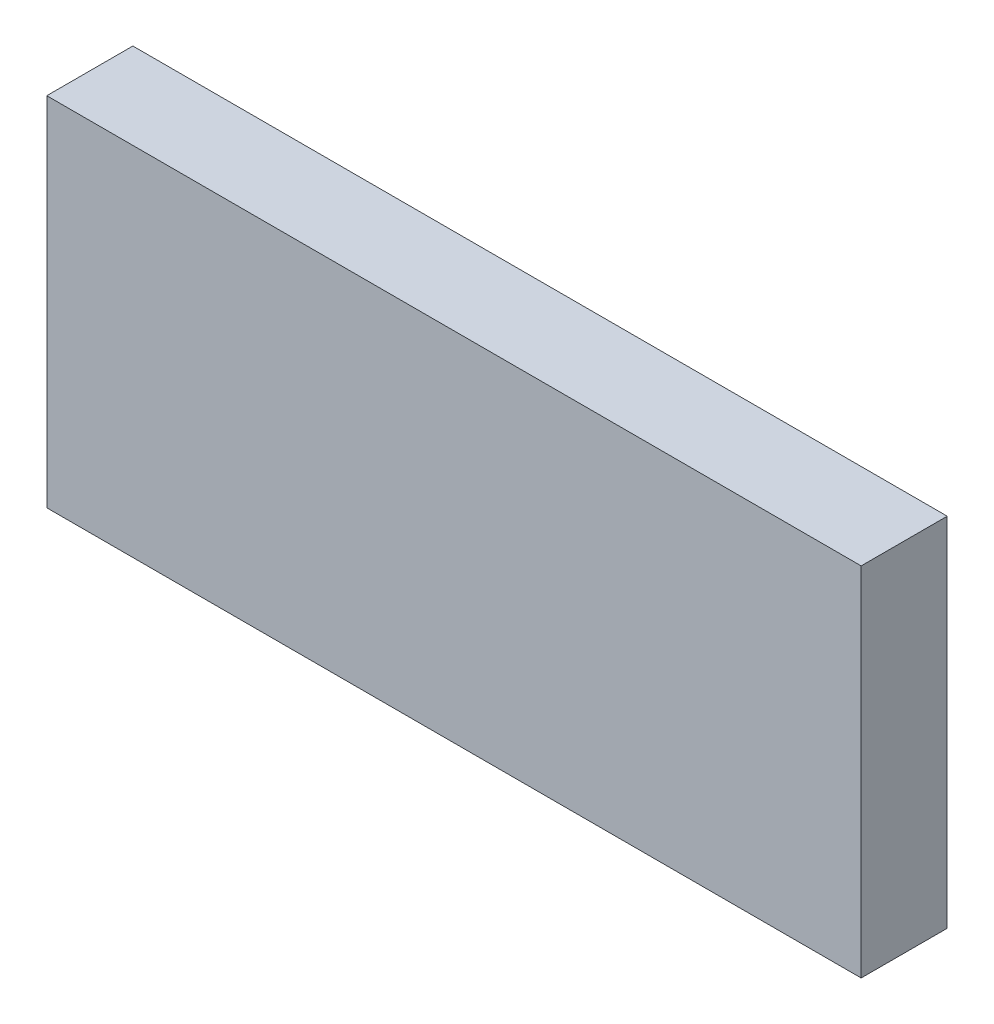
ISO-10303-21;
HEADER;
FILE_DESCRIPTION(('STEP AP214'),'2;1');
FILE_NAME('part.step','',(''),(''),'','','');
FILE_SCHEMA(('AUTOMOTIVE_DESIGN { 1 0 10303 214 1 1 1 1 }'));
ENDSEC;
DATA;
#1=APPLICATION_CONTEXT('core data for automotive mechanical design processes');
#2=APPLICATION_PROTOCOL_DEFINITION('international standard','automotive_design',2000,#1);
#3=PRODUCT_CONTEXT('',#1,'mechanical');
#4=PRODUCT('Part','Part','',(#3));
#5=PRODUCT_RELATED_PRODUCT_CATEGORY('part','',(#4));
#6=PRODUCT_DEFINITION_FORMATION('','',#4);
#7=PRODUCT_DEFINITION_CONTEXT('part definition',#1,'design');
#8=PRODUCT_DEFINITION('design','',#6,#7);
#9=PRODUCT_DEFINITION_SHAPE('','',#8);
#10=(LENGTH_UNIT() NAMED_UNIT(*) SI_UNIT(.MILLI.,.METRE.));
#11=(NAMED_UNIT(*) PLANE_ANGLE_UNIT() SI_UNIT($,.RADIAN.));
#12=(NAMED_UNIT(*) SI_UNIT($,.STERADIAN.) SOLID_ANGLE_UNIT());
#13=UNCERTAINTY_MEASURE_WITH_UNIT(LENGTH_MEASURE(1.E-05),#10,'distance_accuracy_value','');
#14=(GEOMETRIC_REPRESENTATION_CONTEXT(3) GLOBAL_UNCERTAINTY_ASSIGNED_CONTEXT((#13)) GLOBAL_UNIT_ASSIGNED_CONTEXT((#10,
#11,#12)) REPRESENTATION_CONTEXT('',''));
#15=CARTESIAN_POINT('',(0.,0.,0.));
#16=DIRECTION('',(0.,0.,1.));
#17=DIRECTION('',(1.,0.,0.));
#18=AXIS2_PLACEMENT_3D('',#15,#16,#17);
#19=CARTESIAN_POINT('',(-1.2015978,0.52660042,0.));
#20=DIRECTION('',(1.,0.,0.));
#21=DIRECTION('',(0.,-1.,0.));
#22=AXIS2_PLACEMENT_3D('',#19,#20,#21);
#23=PLANE('',#22);
#24=DIRECTION('',(0.,-1.,0.));
#25=VECTOR('',#24,1.);
#26=CARTESIAN_POINT('',(-1.2015978,0.52660042,0.));
#27=LINE('',#26,#25);
#28=CARTESIAN_POINT('',(-1.2015978,0.52660042,0.));
#29=VERTEX_POINT('',#28);
#30=CARTESIAN_POINT('',(-1.2015978,-0.52660042,0.));
#31=VERTEX_POINT('',#30);
#32=EDGE_CURVE('E11',#29,#31,#27,.T.);
#33=ORIENTED_EDGE('',*,*,#32,.T.);
#34=DIRECTION('',(0.,0.,1.));
#35=VECTOR('',#34,1.);
#36=CARTESIAN_POINT('',(-1.2015978,-0.52660042,0.));
#37=LINE('',#36,#35);
#38=CARTESIAN_POINT('',(-1.2015978,-0.52660042,0.254));
#39=VERTEX_POINT('',#38);
#40=EDGE_CURVE('E24',#31,#39,#37,.T.);
#41=ORIENTED_EDGE('',*,*,#40,.T.);
#42=DIRECTION('',(0.,-1.,0.));
#43=VECTOR('',#42,1.);
#44=CARTESIAN_POINT('',(-1.2015978,0.52660042,0.254));
#45=LINE('',#44,#43);
#46=CARTESIAN_POINT('',(-1.2015978,0.52660042,0.254));
#47=VERTEX_POINT('',#46);
#48=EDGE_CURVE('E87',#47,#39,#45,.T.);
#49=ORIENTED_EDGE('',*,*,#48,.F.);
#50=DIRECTION('',(0.,0.,1.));
#51=VECTOR('',#50,1.);
#52=CARTESIAN_POINT('',(-1.2015978,0.52660042,0.));
#53=LINE('',#52,#51);
#54=EDGE_CURVE('E36',#29,#47,#53,.T.);
#55=ORIENTED_EDGE('',*,*,#54,.F.);
#56=EDGE_LOOP('',(#33,#41,#49,#55));
#57=FACE_BOUND('',#56,.T.);
#58=ADVANCED_FACE('F17',(#57),#23,.F.);
#59=CARTESIAN_POINT('',(-1.2015978,-0.52660042,0.));
#60=DIRECTION('',(0.,1.,0.));
#61=DIRECTION('',(1.,0.,0.));
#62=AXIS2_PLACEMENT_3D('',#59,#60,#61);
#63=PLANE('',#62);
#64=DIRECTION('',(1.,0.,0.));
#65=VECTOR('',#64,1.);
#66=CARTESIAN_POINT('',(-1.2015978,-0.52660042,0.));
#67=LINE('',#66,#65);
#68=CARTESIAN_POINT('',(1.20160034,-0.52660042,0.));
#69=VERTEX_POINT('',#68);
#70=EDGE_CURVE('E84',#31,#69,#67,.T.);
#71=ORIENTED_EDGE('',*,*,#70,.T.);
#72=DIRECTION('',(0.,0.,1.));
#73=VECTOR('',#72,1.);
#74=CARTESIAN_POINT('',(1.20160034,-0.52660042,0.));
#75=LINE('',#74,#73);
#76=CARTESIAN_POINT('',(1.20160034,-0.52660042,0.254));
#77=VERTEX_POINT('',#76);
#78=EDGE_CURVE('E82',#69,#77,#75,.T.);
#79=ORIENTED_EDGE('',*,*,#78,.T.);
#80=DIRECTION('',(1.,0.,0.));
#81=VECTOR('',#80,1.);
#82=CARTESIAN_POINT('',(-1.2015978,-0.52660042,0.254));
#83=LINE('',#82,#81);
#84=EDGE_CURVE('E62',#39,#77,#83,.T.);
#85=ORIENTED_EDGE('',*,*,#84,.F.);
#86=ORIENTED_EDGE('',*,*,#40,.F.);
#87=EDGE_LOOP('',(#71,#79,#85,#86));
#88=FACE_BOUND('',#87,.T.);
#89=ADVANCED_FACE('F89',(#88),#63,.F.);
#90=CARTESIAN_POINT('',(1.20160034,-0.52660042,0.));
#91=DIRECTION('',(-1.,0.,0.));
#92=DIRECTION('',(0.,1.,0.));
#93=AXIS2_PLACEMENT_3D('',#90,#91,#92);
#94=PLANE('',#93);
#95=DIRECTION('',(0.,1.,0.));
#96=VECTOR('',#95,1.);
#97=CARTESIAN_POINT('',(1.20160034,-0.52660042,0.));
#98=LINE('',#97,#96);
#99=CARTESIAN_POINT('',(1.20160034,0.52660042,0.));
#100=VERTEX_POINT('',#99);
#101=EDGE_CURVE('E71',#69,#100,#98,.T.);
#102=ORIENTED_EDGE('',*,*,#101,.T.);
#103=DIRECTION('',(0.,0.,1.));
#104=VECTOR('',#103,1.);
#105=CARTESIAN_POINT('',(1.20160034,0.52660042,0.));
#106=LINE('',#105,#104);
#107=CARTESIAN_POINT('',(1.20160034,0.52660042,0.254));
#108=VERTEX_POINT('',#107);
#109=EDGE_CURVE('E65',#100,#108,#106,.T.);
#110=ORIENTED_EDGE('',*,*,#109,.T.);
#111=DIRECTION('',(0.,1.,0.));
#112=VECTOR('',#111,1.);
#113=CARTESIAN_POINT('',(1.20160034,-0.52660042,0.254));
#114=LINE('',#113,#112);
#115=EDGE_CURVE('E57',#77,#108,#114,.T.);
#116=ORIENTED_EDGE('',*,*,#115,.F.);
#117=ORIENTED_EDGE('',*,*,#78,.F.);
#118=EDGE_LOOP('',(#102,#110,#116,#117));
#119=FACE_BOUND('',#118,.T.);
#120=ADVANCED_FACE('F69',(#119),#94,.F.);
#121=CARTESIAN_POINT('',(1.20160034,0.52660042,0.));
#122=DIRECTION('',(0.,-1.,0.));
#123=DIRECTION('',(-1.,0.,0.));
#124=AXIS2_PLACEMENT_3D('',#121,#122,#123);
#125=PLANE('',#124);
#126=DIRECTION('',(-1.,0.,0.));
#127=VECTOR('',#126,1.);
#128=CARTESIAN_POINT('',(1.20160034,0.52660042,0.));
#129=LINE('',#128,#127);
#130=EDGE_CURVE('E66',#100,#29,#129,.T.);
#131=ORIENTED_EDGE('',*,*,#130,.T.);
#132=ORIENTED_EDGE('',*,*,#54,.T.);
#133=DIRECTION('',(-1.,0.,0.));
#134=VECTOR('',#133,1.);
#135=CARTESIAN_POINT('',(1.20160034,0.52660042,0.254));
#136=LINE('',#135,#134);
#137=EDGE_CURVE('E61',#108,#47,#136,.T.);
#138=ORIENTED_EDGE('',*,*,#137,.F.);
#139=ORIENTED_EDGE('',*,*,#109,.F.);
#140=EDGE_LOOP('',(#131,#132,#138,#139));
#141=FACE_BOUND('',#140,.T.);
#142=ADVANCED_FACE('F76',(#141),#125,.F.);
#143=CARTESIAN_POINT('',(-1.2015978,0.52660042,0.));
#144=DIRECTION('',(0.,0.,-1.));
#145=DIRECTION('',(-1.,0.,0.));
#146=AXIS2_PLACEMENT_3D('',#143,#144,#145);
#147=PLANE('',#146);
#148=ORIENTED_EDGE('',*,*,#130,.F.);
#149=ORIENTED_EDGE('',*,*,#101,.F.);
#150=ORIENTED_EDGE('',*,*,#70,.F.);
#151=ORIENTED_EDGE('',*,*,#32,.F.);
#152=EDGE_LOOP('',(#148,#149,#150,#151));
#153=FACE_BOUND('',#152,.T.);
#154=ADVANCED_FACE('F91',(#153),#147,.T.);
#155=CARTESIAN_POINT('',(-1.2015978,0.52660042,0.254));
#156=DIRECTION('',(0.,0.,-1.));
#157=DIRECTION('',(-1.,0.,0.));
#158=AXIS2_PLACEMENT_3D('',#155,#156,#157);
#159=PLANE('',#158);
#160=ORIENTED_EDGE('',*,*,#48,.T.);
#161=ORIENTED_EDGE('',*,*,#84,.T.);
#162=ORIENTED_EDGE('',*,*,#115,.T.);
#163=ORIENTED_EDGE('',*,*,#137,.T.);
#164=EDGE_LOOP('',(#160,#161,#162,#163));
#165=FACE_BOUND('',#164,.T.);
#166=ADVANCED_FACE('F59',(#165),#159,.F.);
#167=CLOSED_SHELL('',(#58,#89,#120,#142,#154,#166));
#168=MANIFOLD_SOLID_BREP('B1',#167);
#169=ADVANCED_BREP_SHAPE_REPRESENTATION('',(#18,#168),#14);
#170=SHAPE_DEFINITION_REPRESENTATION(#9,#169);
ENDSEC;
END-ISO-10303-21;
